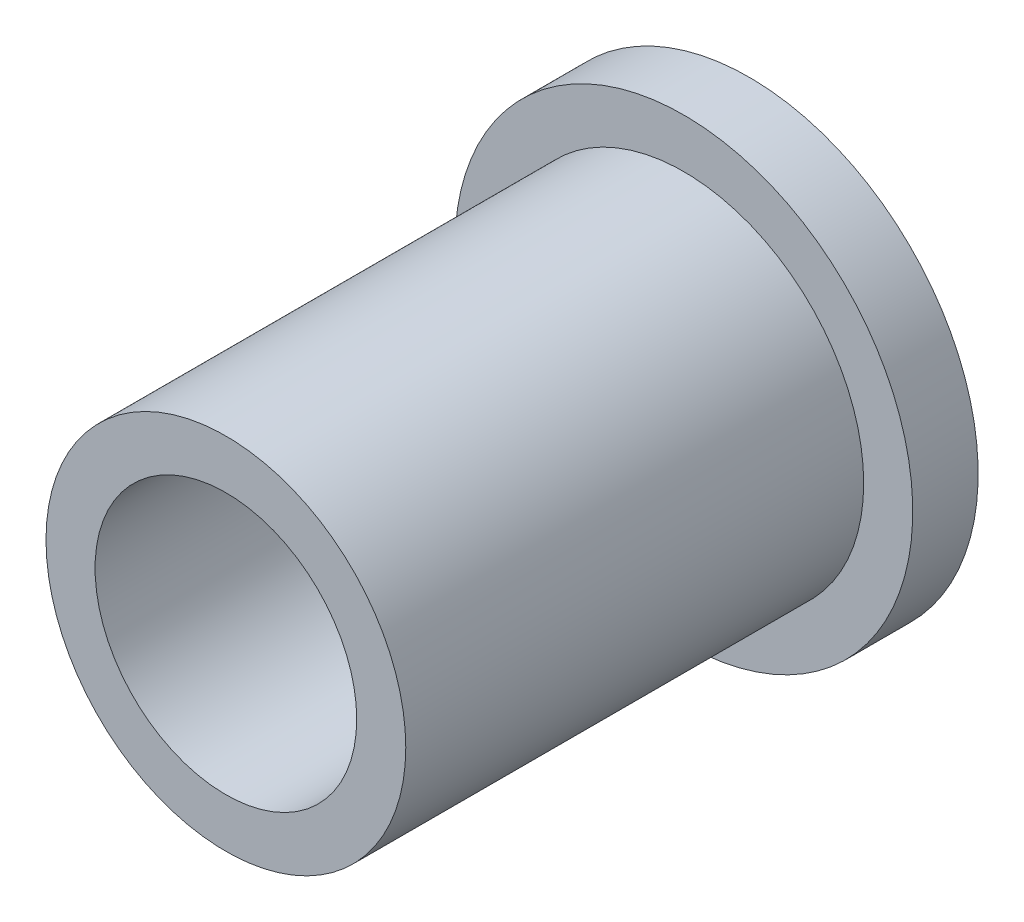
ISO-10303-21;
HEADER;
FILE_DESCRIPTION(('STEP AP214'),'2;1');
FILE_NAME('part.step','',(''),(''),'','','');
FILE_SCHEMA(('AUTOMOTIVE_DESIGN { 1 0 10303 214 1 1 1 1 }'));
ENDSEC;
DATA;
#1=APPLICATION_CONTEXT('core data for automotive mechanical design processes');
#2=APPLICATION_PROTOCOL_DEFINITION('international standard','automotive_design',2000,#1);
#3=PRODUCT_CONTEXT('',#1,'mechanical');
#4=PRODUCT('Part','Part','',(#3));
#5=PRODUCT_RELATED_PRODUCT_CATEGORY('part','',(#4));
#6=PRODUCT_DEFINITION_FORMATION('','',#4);
#7=PRODUCT_DEFINITION_CONTEXT('part definition',#1,'design');
#8=PRODUCT_DEFINITION('design','',#6,#7);
#9=PRODUCT_DEFINITION_SHAPE('','',#8);
#10=(LENGTH_UNIT() NAMED_UNIT(*) SI_UNIT(.MILLI.,.METRE.));
#11=(NAMED_UNIT(*) PLANE_ANGLE_UNIT() SI_UNIT($,.RADIAN.));
#12=(NAMED_UNIT(*) SI_UNIT($,.STERADIAN.) SOLID_ANGLE_UNIT());
#13=UNCERTAINTY_MEASURE_WITH_UNIT(LENGTH_MEASURE(1.E-05),#10,'distance_accuracy_value','');
#14=(GEOMETRIC_REPRESENTATION_CONTEXT(3) GLOBAL_UNCERTAINTY_ASSIGNED_CONTEXT((#13)) GLOBAL_UNIT_ASSIGNED_CONTEXT((#10,
#11,#12)) REPRESENTATION_CONTEXT('',''));
#15=CARTESIAN_POINT('',(0.,0.,0.));
#16=DIRECTION('',(0.,0.,1.));
#17=DIRECTION('',(1.,0.,0.));
#18=AXIS2_PLACEMENT_3D('',#15,#16,#17);
#19=CARTESIAN_POINT('',(0.,0.,8.));
#20=DIRECTION('',(0.,0.,-1.));
#21=DIRECTION('',(-1.,0.,0.));
#22=AXIS2_PLACEMENT_3D('',#19,#20,#21);
#23=CYLINDRICAL_SURFACE('',#22,2.75);
#24=CARTESIAN_POINT('',(0.,0.,8.));
#25=DIRECTION('',(0.,0.,1.));
#26=DIRECTION('',(1.,0.,0.));
#27=AXIS2_PLACEMENT_3D('',#24,#25,#26);
#28=CIRCLE('',#27,2.75);
#29=CARTESIAN_POINT('',(2.75,0.,8.));
#30=VERTEX_POINT('',#29);
#31=EDGE_CURVE('E46',#30,#30,#28,.T.);
#32=ORIENTED_EDGE('',*,*,#31,.F.);
#33=EDGE_LOOP('',(#32));
#34=FACE_BOUND('',#33,.T.);
#35=CARTESIAN_POINT('',(0.,0.,1.));
#36=DIRECTION('',(0.,0.,-1.));
#37=DIRECTION('',(-1.,0.,0.));
#38=AXIS2_PLACEMENT_3D('',#35,#36,#37);
#39=CIRCLE('',#38,2.75);
#40=CARTESIAN_POINT('',(-2.75,0.,1.));
#41=VERTEX_POINT('',#40);
#42=EDGE_CURVE('E10',#41,#41,#39,.T.);
#43=ORIENTED_EDGE('',*,*,#42,.F.);
#44=EDGE_LOOP('',(#43));
#45=FACE_BOUND('',#44,.T.);
#46=ADVANCED_FACE('F40',(#34,#45),#23,.T.);
#47=CARTESIAN_POINT('',(0.,0.,8.));
#48=DIRECTION('',(0.,0.,1.));
#49=DIRECTION('',(1.,0.,0.));
#50=AXIS2_PLACEMENT_3D('',#47,#48,#49);
#51=PLANE('',#50);
#52=ORIENTED_EDGE('',*,*,#31,.T.);
#53=EDGE_LOOP('',(#52));
#54=FACE_BOUND('',#53,.T.);
#55=CARTESIAN_POINT('',(0.,0.,8.));
#56=DIRECTION('',(0.,0.,1.));
#57=DIRECTION('',(1.,0.,0.));
#58=AXIS2_PLACEMENT_3D('',#55,#56,#57);
#59=CIRCLE('',#58,2.);
#60=CARTESIAN_POINT('',(2.,0.,8.));
#61=VERTEX_POINT('',#60);
#62=EDGE_CURVE('E50',#61,#61,#59,.T.);
#63=ORIENTED_EDGE('',*,*,#62,.F.);
#64=EDGE_LOOP('',(#63));
#65=FACE_BOUND('',#64,.T.);
#66=ADVANCED_FACE('F78',(#54,#65),#51,.T.);
#67=CARTESIAN_POINT('',(0.,0.,0.));
#68=DIRECTION('',(0.,0.,1.));
#69=DIRECTION('',(1.,0.,0.));
#70=AXIS2_PLACEMENT_3D('',#67,#68,#69);
#71=PLANE('',#70);
#72=CARTESIAN_POINT('',(0.,0.,0.));
#73=DIRECTION('',(0.,0.,1.));
#74=DIRECTION('',(1.,0.,0.));
#75=AXIS2_PLACEMENT_3D('',#72,#73,#74);
#76=CIRCLE('',#75,2.);
#77=CARTESIAN_POINT('',(2.,0.,0.));
#78=VERTEX_POINT('',#77);
#79=EDGE_CURVE('E54',#78,#78,#76,.T.);
#80=ORIENTED_EDGE('',*,*,#79,.T.);
#81=EDGE_LOOP('',(#80));
#82=FACE_BOUND('',#81,.T.);
#83=CARTESIAN_POINT('',(0.,0.,0.));
#84=DIRECTION('',(0.,0.,-1.));
#85=DIRECTION('',(-1.,0.,0.));
#86=AXIS2_PLACEMENT_3D('',#83,#84,#85);
#87=CIRCLE('',#86,3.5);
#88=CARTESIAN_POINT('',(-3.5,0.,0.));
#89=VERTEX_POINT('',#88);
#90=EDGE_CURVE('E60',#89,#89,#87,.T.);
#91=ORIENTED_EDGE('',*,*,#90,.T.);
#92=EDGE_LOOP('',(#91));
#93=FACE_BOUND('',#92,.T.);
#94=ADVANCED_FACE('F83',(#82,#93),#71,.F.);
#95=CARTESIAN_POINT('',(0.,0.,8.));
#96=DIRECTION('',(0.,0.,-1.));
#97=DIRECTION('',(-1.,0.,0.));
#98=AXIS2_PLACEMENT_3D('',#95,#96,#97);
#99=CYLINDRICAL_SURFACE('',#98,2.);
#100=ORIENTED_EDGE('',*,*,#62,.T.);
#101=EDGE_LOOP('',(#100));
#102=FACE_BOUND('',#101,.T.);
#103=ORIENTED_EDGE('',*,*,#79,.F.);
#104=EDGE_LOOP('',(#103));
#105=FACE_BOUND('',#104,.T.);
#106=ADVANCED_FACE('F75',(#102,#105),#99,.F.);
#107=CARTESIAN_POINT('',(0.,0.,1.));
#108=DIRECTION('',(0.,0.,-1.));
#109=DIRECTION('',(-1.,0.,0.));
#110=AXIS2_PLACEMENT_3D('',#107,#108,#109);
#111=CYLINDRICAL_SURFACE('',#110,3.5);
#112=CARTESIAN_POINT('',(0.,0.,1.));
#113=DIRECTION('',(0.,0.,-1.));
#114=DIRECTION('',(-1.,0.,0.));
#115=AXIS2_PLACEMENT_3D('',#112,#113,#114);
#116=CIRCLE('',#115,3.5);
#117=CARTESIAN_POINT('',(-3.5,0.,1.));
#118=VERTEX_POINT('',#117);
#119=EDGE_CURVE('E58',#118,#118,#116,.T.);
#120=ORIENTED_EDGE('',*,*,#119,.T.);
#121=EDGE_LOOP('',(#120));
#122=FACE_BOUND('',#121,.T.);
#123=ORIENTED_EDGE('',*,*,#90,.F.);
#124=EDGE_LOOP('',(#123));
#125=FACE_BOUND('',#124,.T.);
#126=ADVANCED_FACE('F66',(#122,#125),#111,.T.);
#127=CARTESIAN_POINT('',(0.,0.,1.));
#128=DIRECTION('',(0.,0.,-1.));
#129=DIRECTION('',(-1.,0.,0.));
#130=AXIS2_PLACEMENT_3D('',#127,#128,#129);
#131=PLANE('',#130);
#132=ORIENTED_EDGE('',*,*,#42,.T.);
#133=EDGE_LOOP('',(#132));
#134=FACE_BOUND('',#133,.T.);
#135=ORIENTED_EDGE('',*,*,#119,.F.);
#136=EDGE_LOOP('',(#135));
#137=FACE_BOUND('',#136,.T.);
#138=ADVANCED_FACE('F69',(#134,#137),#131,.F.);
#139=CLOSED_SHELL('',(#46,#66,#94,#106,#126,#138));
#140=MANIFOLD_SOLID_BREP('B2',#139);
#141=ADVANCED_BREP_SHAPE_REPRESENTATION('',(#18,#140),#14);
#142=SHAPE_DEFINITION_REPRESENTATION(#9,#141);
ENDSEC;
END-ISO-10303-21;
